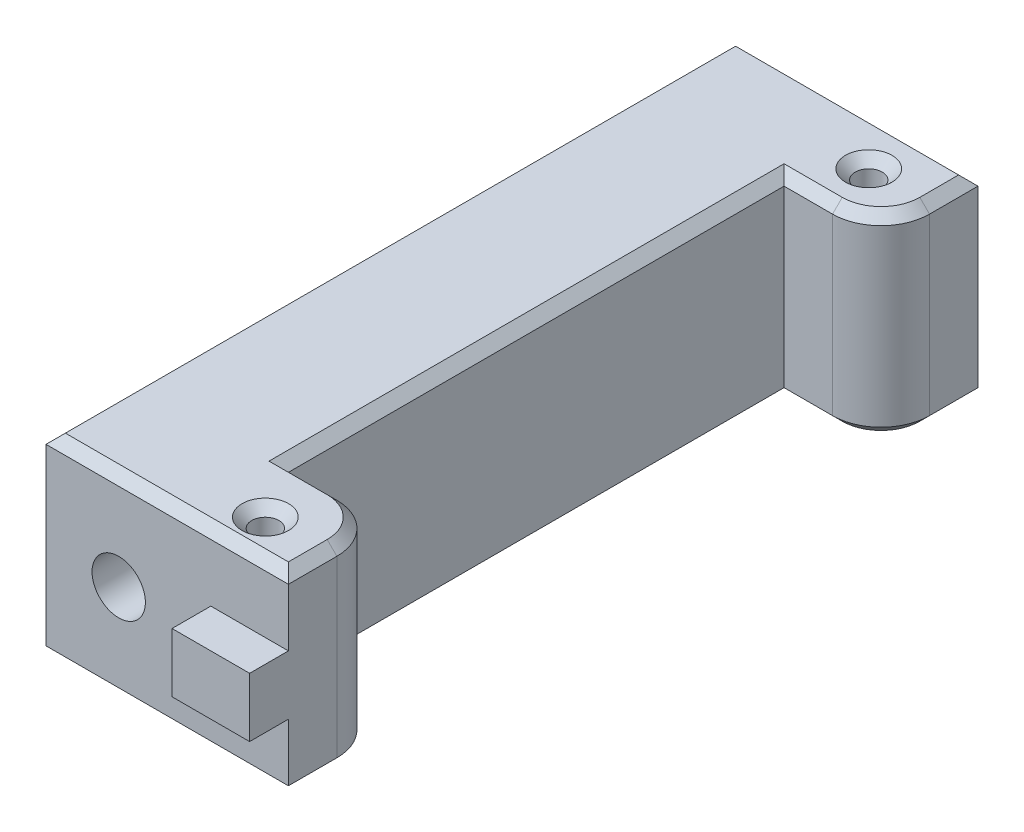
ISO-10303-21;
HEADER;
FILE_DESCRIPTION(('STEP AP214'),'2;1');
FILE_NAME('part.step','',(''),(''),'','','');
FILE_SCHEMA(('AUTOMOTIVE_DESIGN { 1 0 10303 214 1 1 1 1 }'));
ENDSEC;
DATA;
#1=APPLICATION_CONTEXT('core data for automotive mechanical design processes');
#2=APPLICATION_PROTOCOL_DEFINITION('international standard','automotive_design',2000,#1);
#3=PRODUCT_CONTEXT('',#1,'mechanical');
#4=PRODUCT('Part','Part','',(#3));
#5=PRODUCT_RELATED_PRODUCT_CATEGORY('part','',(#4));
#6=PRODUCT_DEFINITION_FORMATION('','',#4);
#7=PRODUCT_DEFINITION_CONTEXT('part definition',#1,'design');
#8=PRODUCT_DEFINITION('design','',#6,#7);
#9=PRODUCT_DEFINITION_SHAPE('','',#8);
#10=(LENGTH_UNIT() NAMED_UNIT(*) SI_UNIT(.MILLI.,.METRE.));
#11=(NAMED_UNIT(*) PLANE_ANGLE_UNIT() SI_UNIT($,.RADIAN.));
#12=(NAMED_UNIT(*) SI_UNIT($,.STERADIAN.) SOLID_ANGLE_UNIT());
#13=UNCERTAINTY_MEASURE_WITH_UNIT(LENGTH_MEASURE(1.E-05),#10,'distance_accuracy_value','');
#14=(GEOMETRIC_REPRESENTATION_CONTEXT(3) GLOBAL_UNCERTAINTY_ASSIGNED_CONTEXT((#13)) GLOBAL_UNIT_ASSIGNED_CONTEXT((#10,
#11,#12)) REPRESENTATION_CONTEXT('',''));
#15=CARTESIAN_POINT('',(0.,0.,0.));
#16=DIRECTION('',(0.,0.,1.));
#17=DIRECTION('',(1.,0.,0.));
#18=AXIS2_PLACEMENT_3D('',#15,#16,#17);
#19=CARTESIAN_POINT('',(25.,20.,0.));
#20=DIRECTION('',(0.,0.,-1.));
#21=DIRECTION('',(-1.,0.,0.));
#22=AXIS2_PLACEMENT_3D('',#19,#20,#21);
#23=PLANE('',#22);
#24=CARTESIAN_POINT('',(7.5,10.,0.));
#25=DIRECTION('',(0.,0.,-1.));
#26=DIRECTION('',(-1.,0.,0.));
#27=AXIS2_PLACEMENT_3D('',#24,#25,#26);
#28=CIRCLE('',#27,2.74999999999998);
#29=CARTESIAN_POINT('',(4.75000000000002,10.,0.));
#30=VERTEX_POINT('',#29);
#31=EDGE_CURVE('E235',#30,#30,#28,.T.);
#32=ORIENTED_EDGE('',*,*,#31,.T.);
#33=EDGE_LOOP('',(#32));
#34=FACE_BOUND('',#33,.T.);
#35=DIRECTION('',(0.,-1.,0.));
#36=VECTOR('',#35,1.);
#37=CARTESIAN_POINT('',(0.,20.,0.));
#38=LINE('',#37,#36);
#39=CARTESIAN_POINT('',(0.,19.,0.));
#40=VERTEX_POINT('',#39);
#41=CARTESIAN_POINT('',(0.,1.,0.));
#42=VERTEX_POINT('',#41);
#43=EDGE_CURVE('E238',#40,#42,#38,.T.);
#44=ORIENTED_EDGE('',*,*,#43,.T.);
#45=DIRECTION('',(1.,0.,0.));
#46=VECTOR('',#45,1.);
#47=CARTESIAN_POINT('',(25.,1.,0.));
#48=LINE('',#47,#46);
#49=CARTESIAN_POINT('',(25.,1.,0.));
#50=VERTEX_POINT('',#49);
#51=EDGE_CURVE('E322',#42,#50,#48,.T.);
#52=ORIENTED_EDGE('',*,*,#51,.T.);
#53=DIRECTION('',(0.,-1.,0.));
#54=VECTOR('',#53,1.);
#55=CARTESIAN_POINT('',(25.,20.,0.));
#56=LINE('',#55,#54);
#57=CARTESIAN_POINT('',(25.,6.95,0.));
#58=VERTEX_POINT('',#57);
#59=EDGE_CURVE('E253',#58,#50,#56,.T.);
#60=ORIENTED_EDGE('',*,*,#59,.F.);
#61=DIRECTION('',(1.,0.,0.));
#62=VECTOR('',#61,1.);
#63=CARTESIAN_POINT('',(17.,6.95,0.));
#64=LINE('',#63,#62);
#65=CARTESIAN_POINT('',(17.,6.95,0.));
#66=VERTEX_POINT('',#65);
#67=EDGE_CURVE('E214',#66,#58,#64,.T.);
#68=ORIENTED_EDGE('',*,*,#67,.F.);
#69=DIRECTION('',(0.,-1.,0.));
#70=VECTOR('',#69,1.);
#71=CARTESIAN_POINT('',(17.,6.95,0.));
#72=LINE('',#71,#70);
#73=CARTESIAN_POINT('',(17.,13.05,0.));
#74=VERTEX_POINT('',#73);
#75=EDGE_CURVE('E944',#74,#66,#72,.T.);
#76=ORIENTED_EDGE('',*,*,#75,.F.);
#77=DIRECTION('',(-1.,0.,0.));
#78=VECTOR('',#77,1.);
#79=CARTESIAN_POINT('',(17.,13.05,0.));
#80=LINE('',#79,#78);
#81=CARTESIAN_POINT('',(25.,13.05,0.));
#82=VERTEX_POINT('',#81);
#83=EDGE_CURVE('E398',#82,#74,#80,.T.);
#84=ORIENTED_EDGE('',*,*,#83,.F.);
#85=CARTESIAN_POINT('',(25.,19.,0.));
#86=VERTEX_POINT('',#85);
#87=EDGE_CURVE('E219',#86,#82,#56,.T.);
#88=ORIENTED_EDGE('',*,*,#87,.F.);
#89=DIRECTION('',(-1.,0.,0.));
#90=VECTOR('',#89,1.);
#91=CARTESIAN_POINT('',(25.,19.,0.));
#92=LINE('',#91,#90);
#93=EDGE_CURVE('E319',#86,#40,#92,.T.);
#94=ORIENTED_EDGE('',*,*,#93,.T.);
#95=EDGE_LOOP('',(#44,#52,#60,#68,#76,#84,#88,#94));
#96=FACE_BOUND('',#95,.T.);
#97=ADVANCED_FACE('F33',(#34,#96),#23,.F.);
#98=CARTESIAN_POINT('',(25.,20.,-10.));
#99=DIRECTION('',(-1.,0.,0.));
#100=DIRECTION('',(0.,0.,1.));
#101=AXIS2_PLACEMENT_3D('',#98,#99,#100);
#102=PLANE('',#101);
#103=ORIENTED_EDGE('',*,*,#59,.T.);
#104=DIRECTION('',(0.,0.,-1.));
#105=VECTOR('',#104,1.);
#106=CARTESIAN_POINT('',(25.,1.,-5.));
#107=LINE('',#106,#105);
#108=CARTESIAN_POINT('',(25.,1.,-5.));
#109=VERTEX_POINT('',#108);
#110=EDGE_CURVE('E326',#50,#109,#107,.T.);
#111=ORIENTED_EDGE('',*,*,#110,.T.);
#112=DIRECTION('',(0.,-1.,0.));
#113=VECTOR('',#112,1.);
#114=CARTESIAN_POINT('',(25.,20.,-5.));
#115=LINE('',#114,#113);
#116=CARTESIAN_POINT('',(25.,19.,-5.));
#117=VERTEX_POINT('',#116);
#118=EDGE_CURVE('E258',#109,#117,#115,.F.);
#119=ORIENTED_EDGE('',*,*,#118,.T.);
#120=DIRECTION('',(0.,0.,1.));
#121=VECTOR('',#120,1.);
#122=CARTESIAN_POINT('',(25.,19.,-10.));
#123=LINE('',#122,#121);
#124=EDGE_CURVE('E324',#117,#86,#123,.T.);
#125=ORIENTED_EDGE('',*,*,#124,.T.);
#126=ORIENTED_EDGE('',*,*,#87,.T.);
#127=DIRECTION('',(0.,0.,-1.));
#128=VECTOR('',#127,1.);
#129=CARTESIAN_POINT('',(25.,13.05,4.));
#130=LINE('',#129,#128);
#131=CARTESIAN_POINT('',(25.,13.05,4.));
#132=VERTEX_POINT('',#131);
#133=EDGE_CURVE('E199',#132,#82,#130,.T.);
#134=ORIENTED_EDGE('',*,*,#133,.F.);
#135=DIRECTION('',(0.,1.,0.));
#136=VECTOR('',#135,1.);
#137=CARTESIAN_POINT('',(25.,6.95,4.));
#138=LINE('',#137,#136);
#139=CARTESIAN_POINT('',(25.,6.95,4.));
#140=VERTEX_POINT('',#139);
#141=EDGE_CURVE('E205',#140,#132,#138,.T.);
#142=ORIENTED_EDGE('',*,*,#141,.F.);
#143=DIRECTION('',(0.,0.,-1.));
#144=VECTOR('',#143,1.);
#145=CARTESIAN_POINT('',(25.,6.95,4.));
#146=LINE('',#145,#144);
#147=EDGE_CURVE('E939',#140,#58,#146,.T.);
#148=ORIENTED_EDGE('',*,*,#147,.T.);
#149=EDGE_LOOP('',(#103,#111,#119,#125,#126,#134,#142,#148));
#150=FACE_BOUND('',#149,.T.);
#151=ADVANCED_FACE('F217',(#150),#102,.F.);
#152=CARTESIAN_POINT('',(15.,20.,-10.));
#153=DIRECTION('',(0.,0.,1.));
#154=DIRECTION('',(1.,0.,0.));
#155=AXIS2_PLACEMENT_3D('',#152,#153,#154);
#156=PLANE('',#155);
#157=DIRECTION('',(0.,-1.,0.));
#158=VECTOR('',#157,1.);
#159=CARTESIAN_POINT('',(20.,20.,-10.));
#160=LINE('',#159,#158);
#161=CARTESIAN_POINT('',(20.,19.,-10.));
#162=VERTEX_POINT('',#161);
#163=CARTESIAN_POINT('',(20.,1.,-10.));
#164=VERTEX_POINT('',#163);
#165=EDGE_CURVE('E255',#162,#164,#160,.T.);
#166=ORIENTED_EDGE('',*,*,#165,.T.);
#167=DIRECTION('',(-1.,0.,0.));
#168=VECTOR('',#167,1.);
#169=CARTESIAN_POINT('',(15.,1.,-10.));
#170=LINE('',#169,#168);
#171=CARTESIAN_POINT('',(15.,1.,-10.));
#172=VERTEX_POINT('',#171);
#173=EDGE_CURVE('E334',#164,#172,#170,.T.);
#174=ORIENTED_EDGE('',*,*,#173,.T.);
#175=DIRECTION('',(0.,-1.,0.));
#176=VECTOR('',#175,1.);
#177=CARTESIAN_POINT('',(15.,20.,-10.));
#178=LINE('',#177,#176);
#179=CARTESIAN_POINT('',(15.,19.,-10.));
#180=VERTEX_POINT('',#179);
#181=EDGE_CURVE('E250',#180,#172,#178,.T.);
#182=ORIENTED_EDGE('',*,*,#181,.F.);
#183=DIRECTION('',(1.,0.,0.));
#184=VECTOR('',#183,1.);
#185=CARTESIAN_POINT('',(15.,19.,-10.));
#186=LINE('',#185,#184);
#187=EDGE_CURVE('E332',#180,#162,#186,.T.);
#188=ORIENTED_EDGE('',*,*,#187,.T.);
#189=EDGE_LOOP('',(#166,#174,#182,#188));
#190=FACE_BOUND('',#189,.T.);
#191=ADVANCED_FACE('F527',(#190),#156,.F.);
#192=CARTESIAN_POINT('',(15.,20.,-61.12));
#193=DIRECTION('',(-1.,0.,0.));
#194=DIRECTION('',(0.,0.,1.));
#195=AXIS2_PLACEMENT_3D('',#192,#193,#194);
#196=PLANE('',#195);
#197=ORIENTED_EDGE('',*,*,#181,.T.);
#198=DIRECTION('',(0.,0.,-1.));
#199=VECTOR('',#198,1.);
#200=CARTESIAN_POINT('',(15.,1.,-61.12));
#201=LINE('',#200,#199);
#202=CARTESIAN_POINT('',(15.,1.,-61.12));
#203=VERTEX_POINT('',#202);
#204=EDGE_CURVE('E269',#172,#203,#201,.T.);
#205=ORIENTED_EDGE('',*,*,#204,.T.);
#206=DIRECTION('',(0.,-1.,0.));
#207=VECTOR('',#206,1.);
#208=CARTESIAN_POINT('',(15.,20.,-61.12));
#209=LINE('',#208,#207);
#210=CARTESIAN_POINT('',(15.,19.,-61.12));
#211=VERTEX_POINT('',#210);
#212=EDGE_CURVE('E247',#211,#203,#209,.T.);
#213=ORIENTED_EDGE('',*,*,#212,.F.);
#214=DIRECTION('',(0.,0.,1.));
#215=VECTOR('',#214,1.);
#216=CARTESIAN_POINT('',(15.,19.,-61.12));
#217=LINE('',#216,#215);
#218=EDGE_CURVE('E267',#211,#180,#217,.T.);
#219=ORIENTED_EDGE('',*,*,#218,.T.);
#220=EDGE_LOOP('',(#197,#205,#213,#219));
#221=FACE_BOUND('',#220,.T.);
#222=ADVANCED_FACE('F442',(#221),#196,.F.);
#223=CARTESIAN_POINT('',(25.,20.,-61.12));
#224=DIRECTION('',(0.,0.,-1.));
#225=DIRECTION('',(-1.,0.,0.));
#226=AXIS2_PLACEMENT_3D('',#223,#224,#225);
#227=PLANE('',#226);
#228=ORIENTED_EDGE('',*,*,#212,.T.);
#229=DIRECTION('',(1.,0.,0.));
#230=VECTOR('',#229,1.);
#231=CARTESIAN_POINT('',(20.,1.,-61.12));
#232=LINE('',#231,#230);
#233=CARTESIAN_POINT('',(20.,1.,-61.12));
#234=VERTEX_POINT('',#233);
#235=EDGE_CURVE('E301',#203,#234,#232,.T.);
#236=ORIENTED_EDGE('',*,*,#235,.T.);
#237=DIRECTION('',(0.,-1.,0.));
#238=VECTOR('',#237,1.);
#239=CARTESIAN_POINT('',(20.,20.,-61.12));
#240=LINE('',#239,#238);
#241=CARTESIAN_POINT('',(20.,19.,-61.12));
#242=VERTEX_POINT('',#241);
#243=EDGE_CURVE('E264',#234,#242,#240,.F.);
#244=ORIENTED_EDGE('',*,*,#243,.T.);
#245=DIRECTION('',(-1.,0.,0.));
#246=VECTOR('',#245,1.);
#247=CARTESIAN_POINT('',(25.,19.,-61.12));
#248=LINE('',#247,#246);
#249=EDGE_CURVE('E299',#242,#211,#248,.T.);
#250=ORIENTED_EDGE('',*,*,#249,.T.);
#251=EDGE_LOOP('',(#228,#236,#244,#250));
#252=FACE_BOUND('',#251,.T.);
#253=ADVANCED_FACE('F439',(#252),#227,.F.);
#254=CARTESIAN_POINT('',(25.,20.,-71.12));
#255=DIRECTION('',(-1.,0.,0.));
#256=DIRECTION('',(0.,0.,1.));
#257=AXIS2_PLACEMENT_3D('',#254,#255,#256);
#258=PLANE('',#257);
#259=DIRECTION('',(0.,-1.,0.));
#260=VECTOR('',#259,1.);
#261=CARTESIAN_POINT('',(25.,20.,-66.12));
#262=LINE('',#261,#260);
#263=CARTESIAN_POINT('',(25.,19.,-66.12));
#264=VERTEX_POINT('',#263);
#265=CARTESIAN_POINT('',(25.,1.,-66.12));
#266=VERTEX_POINT('',#265);
#267=EDGE_CURVE('E261',#264,#266,#262,.T.);
#268=ORIENTED_EDGE('',*,*,#267,.T.);
#269=DIRECTION('',(0.,0.,-1.));
#270=VECTOR('',#269,1.);
#271=CARTESIAN_POINT('',(25.,1.,-71.12));
#272=LINE('',#271,#270);
#273=CARTESIAN_POINT('',(25.,1.,-71.12));
#274=VERTEX_POINT('',#273);
#275=EDGE_CURVE('E309',#266,#274,#272,.T.);
#276=ORIENTED_EDGE('',*,*,#275,.T.);
#277=DIRECTION('',(0.,-1.,0.));
#278=VECTOR('',#277,1.);
#279=CARTESIAN_POINT('',(25.,20.,-71.12));
#280=LINE('',#279,#278);
#281=CARTESIAN_POINT('',(25.,19.,-71.12));
#282=VERTEX_POINT('',#281);
#283=EDGE_CURVE('E244',#282,#274,#280,.T.);
#284=ORIENTED_EDGE('',*,*,#283,.F.);
#285=DIRECTION('',(0.,0.,1.));
#286=VECTOR('',#285,1.);
#287=CARTESIAN_POINT('',(25.,19.,-71.12));
#288=LINE('',#287,#286);
#289=EDGE_CURVE('E307',#282,#264,#288,.T.);
#290=ORIENTED_EDGE('',*,*,#289,.T.);
#291=EDGE_LOOP('',(#268,#276,#284,#290));
#292=FACE_BOUND('',#291,.T.);
#293=ADVANCED_FACE('F471',(#292),#258,.F.);
#294=CARTESIAN_POINT('',(0.,20.,-71.12));
#295=DIRECTION('',(0.,0.,1.));
#296=DIRECTION('',(1.,0.,0.));
#297=AXIS2_PLACEMENT_3D('',#294,#295,#296);
#298=PLANE('',#297);
#299=CARTESIAN_POINT('',(7.5,10.,-71.12));
#300=DIRECTION('',(0.,0.,-1.));
#301=DIRECTION('',(-1.,0.,0.));
#302=AXIS2_PLACEMENT_3D('',#299,#300,#301);
#303=CIRCLE('',#302,5.);
#304=CARTESIAN_POINT('',(2.5,10.,-71.12));
#305=VERTEX_POINT('',#304);
#306=EDGE_CURVE('E221',#305,#305,#303,.T.);
#307=ORIENTED_EDGE('',*,*,#306,.F.);
#308=EDGE_LOOP('',(#307));
#309=FACE_BOUND('',#308,.T.);
#310=ORIENTED_EDGE('',*,*,#283,.T.);
#311=DIRECTION('',(-1.,0.,0.));
#312=VECTOR('',#311,1.);
#313=CARTESIAN_POINT('',(0.,1.,-71.12));
#314=LINE('',#313,#312);
#315=CARTESIAN_POINT('',(0.,1.,-71.12));
#316=VERTEX_POINT('',#315);
#317=EDGE_CURVE('E313',#274,#316,#314,.T.);
#318=ORIENTED_EDGE('',*,*,#317,.T.);
#319=DIRECTION('',(0.,-1.,0.));
#320=VECTOR('',#319,1.);
#321=CARTESIAN_POINT('',(0.,20.,-71.12));
#322=LINE('',#321,#320);
#323=CARTESIAN_POINT('',(0.,19.,-71.12));
#324=VERTEX_POINT('',#323);
#325=EDGE_CURVE('E241',#324,#316,#322,.T.);
#326=ORIENTED_EDGE('',*,*,#325,.F.);
#327=DIRECTION('',(1.,0.,0.));
#328=VECTOR('',#327,1.);
#329=CARTESIAN_POINT('',(0.,19.,-71.12));
#330=LINE('',#329,#328);
#331=EDGE_CURVE('E311',#324,#282,#330,.T.);
#332=ORIENTED_EDGE('',*,*,#331,.T.);
#333=EDGE_LOOP('',(#310,#318,#326,#332));
#334=FACE_BOUND('',#333,.T.);
#335=ADVANCED_FACE('F475',(#309,#334),#298,.F.);
#336=CARTESIAN_POINT('',(0.,20.,0.));
#337=DIRECTION('',(1.,0.,0.));
#338=DIRECTION('',(0.,0.,-1.));
#339=AXIS2_PLACEMENT_3D('',#336,#337,#338);
#340=PLANE('',#339);
#341=ORIENTED_EDGE('',*,*,#325,.T.);
#342=DIRECTION('',(0.,0.,1.));
#343=VECTOR('',#342,1.);
#344=CARTESIAN_POINT('',(0.,1.,0.));
#345=LINE('',#344,#343);
#346=EDGE_CURVE('E317',#316,#42,#345,.T.);
#347=ORIENTED_EDGE('',*,*,#346,.T.);
#348=ORIENTED_EDGE('',*,*,#43,.F.);
#349=DIRECTION('',(0.,0.,-1.));
#350=VECTOR('',#349,1.);
#351=CARTESIAN_POINT('',(0.,19.,0.));
#352=LINE('',#351,#350);
#353=EDGE_CURVE('E315',#40,#324,#352,.T.);
#354=ORIENTED_EDGE('',*,*,#353,.T.);
#355=EDGE_LOOP('',(#341,#347,#348,#354));
#356=FACE_BOUND('',#355,.T.);
#357=ADVANCED_FACE('F490',(#356),#340,.F.);
#358=CARTESIAN_POINT('',(0.,20.,0.));
#359=DIRECTION('',(0.,-1.,0.));
#360=DIRECTION('',(0.,0.,-1.));
#361=AXIS2_PLACEMENT_3D('',#358,#359,#360);
#362=PLANE('',#361);
#363=DIRECTION('',(0.,0.,1.));
#364=VECTOR('',#363,1.);
#365=CARTESIAN_POINT('',(1.00000000000001,20.,0.));
#366=LINE('',#365,#364);
#367=CARTESIAN_POINT('',(1.00000000000001,20.,-70.12));
#368=VERTEX_POINT('',#367);
#369=CARTESIAN_POINT('',(1.00000000000001,20.,-1.00000000000001));
#370=VERTEX_POINT('',#369);
#371=EDGE_CURVE('E42',#368,#370,#366,.T.);
#372=ORIENTED_EDGE('',*,*,#371,.T.);
#373=DIRECTION('',(1.,0.,0.));
#374=VECTOR('',#373,1.);
#375=CARTESIAN_POINT('',(0.,20.,-1.00000000000001));
#376=LINE('',#375,#374);
#377=CARTESIAN_POINT('',(24.,20.,-1.00000000000002));
#378=VERTEX_POINT('',#377);
#379=EDGE_CURVE('E11',#370,#378,#376,.T.);
#380=ORIENTED_EDGE('',*,*,#379,.T.);
#381=DIRECTION('',(0.,0.,-1.));
#382=VECTOR('',#381,1.);
#383=CARTESIAN_POINT('',(24.,20.,0.));
#384=LINE('',#383,#382);
#385=CARTESIAN_POINT('',(24.,20.,-5.));
#386=VERTEX_POINT('',#385);
#387=EDGE_CURVE('E354',#378,#386,#384,.T.);
#388=ORIENTED_EDGE('',*,*,#387,.T.);
#389=CARTESIAN_POINT('',(20.,20.,-5.));
#390=DIRECTION('',(0.,-1.,0.));
#391=DIRECTION('',(0.,0.,-1.));
#392=AXIS2_PLACEMENT_3D('',#389,#390,#391);
#393=CIRCLE('',#392,3.99999999999999);
#394=CARTESIAN_POINT('',(20.,20.,-8.99999999999999));
#395=VERTEX_POINT('',#394);
#396=EDGE_CURVE('E356',#386,#395,#393,.F.);
#397=ORIENTED_EDGE('',*,*,#396,.T.);
#398=DIRECTION('',(-1.,0.,0.));
#399=VECTOR('',#398,1.);
#400=CARTESIAN_POINT('',(0.,20.,-8.99999999999999));
#401=LINE('',#400,#399);
#402=CARTESIAN_POINT('',(14.,20.,-8.99999999999999));
#403=VERTEX_POINT('',#402);
#404=EDGE_CURVE('E358',#395,#403,#401,.T.);
#405=ORIENTED_EDGE('',*,*,#404,.T.);
#406=DIRECTION('',(0.,0.,-1.));
#407=VECTOR('',#406,1.);
#408=CARTESIAN_POINT('',(14.,20.,0.));
#409=LINE('',#408,#407);
#410=CARTESIAN_POINT('',(14.,20.,-62.12));
#411=VERTEX_POINT('',#410);
#412=EDGE_CURVE('E360',#403,#411,#409,.T.);
#413=ORIENTED_EDGE('',*,*,#412,.T.);
#414=DIRECTION('',(1.,0.,0.));
#415=VECTOR('',#414,1.);
#416=CARTESIAN_POINT('',(0.,20.,-62.12));
#417=LINE('',#416,#415);
#418=CARTESIAN_POINT('',(20.,20.,-62.12));
#419=VERTEX_POINT('',#418);
#420=EDGE_CURVE('E362',#411,#419,#417,.T.);
#421=ORIENTED_EDGE('',*,*,#420,.T.);
#422=CARTESIAN_POINT('',(20.,20.,-66.12));
#423=DIRECTION('',(0.,-1.,0.));
#424=DIRECTION('',(0.,0.,-1.));
#425=AXIS2_PLACEMENT_3D('',#422,#423,#424);
#426=CIRCLE('',#425,3.99999999999999);
#427=CARTESIAN_POINT('',(24.,20.,-66.12));
#428=VERTEX_POINT('',#427);
#429=EDGE_CURVE('E364',#419,#428,#426,.F.);
#430=ORIENTED_EDGE('',*,*,#429,.T.);
#431=DIRECTION('',(0.,0.,-1.));
#432=VECTOR('',#431,1.);
#433=CARTESIAN_POINT('',(24.,20.,0.));
#434=LINE('',#433,#432);
#435=CARTESIAN_POINT('',(24.,20.,-70.12));
#436=VERTEX_POINT('',#435);
#437=EDGE_CURVE('E366',#428,#436,#434,.T.);
#438=ORIENTED_EDGE('',*,*,#437,.T.);
#439=DIRECTION('',(-1.,0.,0.));
#440=VECTOR('',#439,1.);
#441=CARTESIAN_POINT('',(0.,20.,-70.12));
#442=LINE('',#441,#440);
#443=EDGE_CURVE('E53',#436,#368,#442,.T.);
#444=ORIENTED_EDGE('',*,*,#443,.T.);
#445=EDGE_LOOP('',(#372,#380,#388,#397,#405,#413,#421,#430,#438,#444));
#446=FACE_BOUND('',#445,.T.);
#447=CARTESIAN_POINT('',(18.81,20.,-66.04));
#448=DIRECTION('',(0.,-1.,0.));
#449=DIRECTION('',(0.,0.,-1.));
#450=AXIS2_PLACEMENT_3D('',#447,#448,#449);
#451=CIRCLE('',#450,2.39999999999999);
#452=CARTESIAN_POINT('',(18.81,20.,-68.44));
#453=VERTEX_POINT('',#452);
#454=EDGE_CURVE('E351',#453,#453,#451,.T.);
#455=ORIENTED_EDGE('',*,*,#454,.T.);
#456=EDGE_LOOP('',(#455));
#457=FACE_BOUND('',#456,.T.);
#458=CARTESIAN_POINT('',(18.81,20.,-3.81));
#459=DIRECTION('',(0.,-1.,0.));
#460=DIRECTION('',(0.,0.,-1.));
#461=AXIS2_PLACEMENT_3D('',#458,#459,#460);
#462=CIRCLE('',#461,2.40000000000002);
#463=CARTESIAN_POINT('',(18.81,20.,-6.21000000000002));
#464=VERTEX_POINT('',#463);
#465=EDGE_CURVE('E348',#464,#464,#462,.T.);
#466=ORIENTED_EDGE('',*,*,#465,.T.);
#467=EDGE_LOOP('',(#466));
#468=FACE_BOUND('',#467,.T.);
#469=ADVANCED_FACE('F504',(#446,#457,#468),#362,.F.);
#470=CARTESIAN_POINT('',(0.,0.,0.));
#471=DIRECTION('',(0.,-1.,0.));
#472=DIRECTION('',(0.,0.,-1.));
#473=AXIS2_PLACEMENT_3D('',#470,#471,#472);
#474=PLANE('',#473);
#475=DIRECTION('',(-1.,0.,0.));
#476=VECTOR('',#475,1.);
#477=CARTESIAN_POINT('',(15.,0.,-62.12));
#478=LINE('',#477,#476);
#479=CARTESIAN_POINT('',(20.,0.,-62.12));
#480=VERTEX_POINT('',#479);
#481=CARTESIAN_POINT('',(14.,0.,-62.12));
#482=VERTEX_POINT('',#481);
#483=EDGE_CURVE('E294',#480,#482,#478,.T.);
#484=ORIENTED_EDGE('',*,*,#483,.T.);
#485=DIRECTION('',(0.,0.,1.));
#486=VECTOR('',#485,1.);
#487=CARTESIAN_POINT('',(14.,0.,-10.));
#488=LINE('',#487,#486);
#489=CARTESIAN_POINT('',(14.,0.,-8.99999999999999));
#490=VERTEX_POINT('',#489);
#491=EDGE_CURVE('E296',#482,#490,#488,.T.);
#492=ORIENTED_EDGE('',*,*,#491,.T.);
#493=DIRECTION('',(1.,0.,0.));
#494=VECTOR('',#493,1.);
#495=CARTESIAN_POINT('',(20.,0.,-8.99999999999999));
#496=LINE('',#495,#494);
#497=CARTESIAN_POINT('',(20.,0.,-8.99999999999999));
#498=VERTEX_POINT('',#497);
#499=EDGE_CURVE('E278',#490,#498,#496,.T.);
#500=ORIENTED_EDGE('',*,*,#499,.T.);
#501=CARTESIAN_POINT('',(20.,0.,-5.));
#502=DIRECTION('',(0.,-1.,0.));
#503=DIRECTION('',(0.,0.,-1.));
#504=AXIS2_PLACEMENT_3D('',#501,#502,#503);
#505=CIRCLE('',#504,3.99999999999999);
#506=CARTESIAN_POINT('',(24.,0.,-5.));
#507=VERTEX_POINT('',#506);
#508=EDGE_CURVE('E280',#498,#507,#505,.T.);
#509=ORIENTED_EDGE('',*,*,#508,.T.);
#510=DIRECTION('',(0.,0.,1.));
#511=VECTOR('',#510,1.);
#512=CARTESIAN_POINT('',(24.,0.,0.));
#513=LINE('',#512,#511);
#514=CARTESIAN_POINT('',(24.,0.,-1.00000000000001));
#515=VERTEX_POINT('',#514);
#516=EDGE_CURVE('E282',#507,#515,#513,.T.);
#517=ORIENTED_EDGE('',*,*,#516,.T.);
#518=DIRECTION('',(-1.,0.,0.));
#519=VECTOR('',#518,1.);
#520=CARTESIAN_POINT('',(0.,0.,-1.00000000000001));
#521=LINE('',#520,#519);
#522=CARTESIAN_POINT('',(1.00000000000001,0.,-1.00000000000001));
#523=VERTEX_POINT('',#522);
#524=EDGE_CURVE('E284',#515,#523,#521,.T.);
#525=ORIENTED_EDGE('',*,*,#524,.T.);
#526=DIRECTION('',(0.,0.,-1.));
#527=VECTOR('',#526,1.);
#528=CARTESIAN_POINT('',(1.00000000000001,0.,-71.12));
#529=LINE('',#528,#527);
#530=CARTESIAN_POINT('',(1.00000000000001,0.,-70.12));
#531=VERTEX_POINT('',#530);
#532=EDGE_CURVE('E286',#523,#531,#529,.T.);
#533=ORIENTED_EDGE('',*,*,#532,.T.);
#534=DIRECTION('',(1.,0.,0.));
#535=VECTOR('',#534,1.);
#536=CARTESIAN_POINT('',(25.,0.,-70.12));
#537=LINE('',#536,#535);
#538=CARTESIAN_POINT('',(24.,0.,-70.12));
#539=VERTEX_POINT('',#538);
#540=EDGE_CURVE('E288',#531,#539,#537,.T.);
#541=ORIENTED_EDGE('',*,*,#540,.T.);
#542=DIRECTION('',(0.,0.,1.));
#543=VECTOR('',#542,1.);
#544=CARTESIAN_POINT('',(24.,0.,-66.12));
#545=LINE('',#544,#543);
#546=CARTESIAN_POINT('',(24.,0.,-66.12));
#547=VERTEX_POINT('',#546);
#548=EDGE_CURVE('E290',#539,#547,#545,.T.);
#549=ORIENTED_EDGE('',*,*,#548,.T.);
#550=CARTESIAN_POINT('',(20.,0.,-66.12));
#551=DIRECTION('',(0.,-1.,0.));
#552=DIRECTION('',(0.,0.,-1.));
#553=AXIS2_PLACEMENT_3D('',#550,#551,#552);
#554=CIRCLE('',#553,4.);
#555=EDGE_CURVE('E292',#547,#480,#554,.T.);
#556=ORIENTED_EDGE('',*,*,#555,.T.);
#557=EDGE_LOOP('',(#484,#492,#500,#509,#517,#525,#533,#541,#549,#556));
#558=FACE_BOUND('',#557,.T.);
#559=CARTESIAN_POINT('',(18.81,0.,-66.04));
#560=DIRECTION('',(0.,-1.,0.));
#561=DIRECTION('',(0.,0.,-1.));
#562=AXIS2_PLACEMENT_3D('',#559,#560,#561);
#563=CIRCLE('',#562,2.4);
#564=CARTESIAN_POINT('',(18.81,0.,-68.44));
#565=VERTEX_POINT('',#564);
#566=EDGE_CURVE('E275',#565,#565,#563,.F.);
#567=ORIENTED_EDGE('',*,*,#566,.T.);
#568=EDGE_LOOP('',(#567));
#569=FACE_BOUND('',#568,.T.);
#570=CARTESIAN_POINT('',(18.81,0.,-3.81));
#571=DIRECTION('',(0.,-1.,0.));
#572=DIRECTION('',(0.,0.,-1.));
#573=AXIS2_PLACEMENT_3D('',#570,#571,#572);
#574=CIRCLE('',#573,2.40000000000001);
#575=CARTESIAN_POINT('',(18.81,0.,-6.21000000000001));
#576=VERTEX_POINT('',#575);
#577=EDGE_CURVE('E272',#576,#576,#574,.F.);
#578=ORIENTED_EDGE('',*,*,#577,.T.);
#579=EDGE_LOOP('',(#578));
#580=FACE_BOUND('',#579,.T.);
#581=ADVANCED_FACE('F507',(#558,#569,#580),#474,.T.);
#582=CARTESIAN_POINT('',(7.5,10.,-71.12));
#583=DIRECTION('',(0.,0.,-1.));
#584=DIRECTION('',(-1.,0.,0.));
#585=AXIS2_PLACEMENT_3D('',#582,#583,#584);
#586=CYLINDRICAL_SURFACE('',#585,2.74999999999998);
#587=ORIENTED_EDGE('',*,*,#31,.F.);
#588=EDGE_LOOP('',(#587));
#589=FACE_BOUND('',#588,.T.);
#590=CARTESIAN_POINT('',(7.5,10.,-6.11999999999999));
#591=DIRECTION('',(0.,0.,-1.));
#592=DIRECTION('',(-1.,0.,0.));
#593=AXIS2_PLACEMENT_3D('',#590,#591,#592);
#594=CIRCLE('',#593,2.74999999999998);
#595=CARTESIAN_POINT('',(4.75000000000001,10.,-6.11999999999999));
#596=VERTEX_POINT('',#595);
#597=EDGE_CURVE('E232',#596,#596,#594,.T.);
#598=ORIENTED_EDGE('',*,*,#597,.T.);
#599=EDGE_LOOP('',(#598));
#600=FACE_BOUND('',#599,.T.);
#601=ADVANCED_FACE('F825',(#589,#600),#586,.F.);
#602=CARTESIAN_POINT('',(10.25,10.,-6.11999999999999));
#603=DIRECTION('',(0.,0.,1.));
#604=DIRECTION('',(1.,0.,0.));
#605=AXIS2_PLACEMENT_3D('',#602,#603,#604);
#606=PLANE('',#605);
#607=ORIENTED_EDGE('',*,*,#597,.F.);
#608=EDGE_LOOP('',(#607));
#609=FACE_BOUND('',#608,.T.);
#610=CARTESIAN_POINT('',(7.5,10.,-6.11999999999999));
#611=DIRECTION('',(0.,0.,-1.));
#612=DIRECTION('',(-1.,0.,0.));
#613=AXIS2_PLACEMENT_3D('',#610,#611,#612);
#614=CIRCLE('',#613,4.99999999999998);
#615=CARTESIAN_POINT('',(2.50000000000001,10.,-6.11999999999999));
#616=VERTEX_POINT('',#615);
#617=EDGE_CURVE('E224',#616,#616,#614,.T.);
#618=ORIENTED_EDGE('',*,*,#617,.T.);
#619=EDGE_LOOP('',(#618));
#620=FACE_BOUND('',#619,.T.);
#621=ADVANCED_FACE('F816',(#609,#620),#606,.F.);
#622=CARTESIAN_POINT('',(7.5,10.,-71.12));
#623=DIRECTION('',(0.,0.,-1.));
#624=DIRECTION('',(-1.,0.,0.));
#625=AXIS2_PLACEMENT_3D('',#622,#623,#624);
#626=CYLINDRICAL_SURFACE('',#625,4.99999999999999);
#627=ORIENTED_EDGE('',*,*,#617,.F.);
#628=EDGE_LOOP('',(#627));
#629=FACE_BOUND('',#628,.T.);
#630=ORIENTED_EDGE('',*,*,#306,.T.);
#631=EDGE_LOOP('',(#630));
#632=FACE_BOUND('',#631,.T.);
#633=ADVANCED_FACE('F794',(#629,#632),#626,.F.);
#634=CARTESIAN_POINT('',(17.,13.05,4.));
#635=DIRECTION('',(0.,-1.,0.));
#636=DIRECTION('',(0.,0.,-1.));
#637=AXIS2_PLACEMENT_3D('',#634,#635,#636);
#638=PLANE('',#637);
#639=ORIENTED_EDGE('',*,*,#83,.T.);
#640=DIRECTION('',(0.,0.,-1.));
#641=VECTOR('',#640,1.);
#642=CARTESIAN_POINT('',(17.,13.05,4.));
#643=LINE('',#642,#641);
#644=CARTESIAN_POINT('',(17.,13.05,4.));
#645=VERTEX_POINT('',#644);
#646=EDGE_CURVE('E201',#645,#74,#643,.T.);
#647=ORIENTED_EDGE('',*,*,#646,.F.);
#648=DIRECTION('',(-1.,0.,0.));
#649=VECTOR('',#648,1.);
#650=CARTESIAN_POINT('',(17.,13.05,4.));
#651=LINE('',#650,#649);
#652=EDGE_CURVE('E194',#132,#645,#651,.T.);
#653=ORIENTED_EDGE('',*,*,#652,.F.);
#654=ORIENTED_EDGE('',*,*,#133,.T.);
#655=EDGE_LOOP('',(#639,#647,#653,#654));
#656=FACE_BOUND('',#655,.T.);
#657=ADVANCED_FACE('F197',(#656),#638,.F.);
#658=CARTESIAN_POINT('',(17.,6.95,4.));
#659=DIRECTION('',(1.,0.,0.));
#660=DIRECTION('',(0.,0.,-1.));
#661=AXIS2_PLACEMENT_3D('',#658,#659,#660);
#662=PLANE('',#661);
#663=ORIENTED_EDGE('',*,*,#75,.T.);
#664=DIRECTION('',(0.,0.,-1.));
#665=VECTOR('',#664,1.);
#666=CARTESIAN_POINT('',(17.,6.95,4.));
#667=LINE('',#666,#665);
#668=CARTESIAN_POINT('',(17.,6.95,4.));
#669=VERTEX_POINT('',#668);
#670=EDGE_CURVE('E226',#669,#66,#667,.T.);
#671=ORIENTED_EDGE('',*,*,#670,.F.);
#672=DIRECTION('',(0.,-1.,0.));
#673=VECTOR('',#672,1.);
#674=CARTESIAN_POINT('',(17.,6.95,4.));
#675=LINE('',#674,#673);
#676=EDGE_CURVE('E204',#645,#669,#675,.T.);
#677=ORIENTED_EDGE('',*,*,#676,.F.);
#678=ORIENTED_EDGE('',*,*,#646,.T.);
#679=EDGE_LOOP('',(#663,#671,#677,#678));
#680=FACE_BOUND('',#679,.T.);
#681=ADVANCED_FACE('F777',(#680),#662,.F.);
#682=CARTESIAN_POINT('',(17.,6.95,4.));
#683=DIRECTION('',(0.,1.,0.));
#684=DIRECTION('',(0.,0.,1.));
#685=AXIS2_PLACEMENT_3D('',#682,#683,#684);
#686=PLANE('',#685);
#687=ORIENTED_EDGE('',*,*,#67,.T.);
#688=ORIENTED_EDGE('',*,*,#147,.F.);
#689=DIRECTION('',(1.,0.,0.));
#690=VECTOR('',#689,1.);
#691=CARTESIAN_POINT('',(17.,6.95,4.));
#692=LINE('',#691,#690);
#693=EDGE_CURVE('E210',#669,#140,#692,.T.);
#694=ORIENTED_EDGE('',*,*,#693,.F.);
#695=ORIENTED_EDGE('',*,*,#670,.T.);
#696=EDGE_LOOP('',(#687,#688,#694,#695));
#697=FACE_BOUND('',#696,.T.);
#698=ADVANCED_FACE('F769',(#697),#686,.F.);
#699=CARTESIAN_POINT('',(0.,0.,4.));
#700=DIRECTION('',(0.,0.,-1.));
#701=DIRECTION('',(-1.,0.,0.));
#702=AXIS2_PLACEMENT_3D('',#699,#700,#701);
#703=PLANE('',#702);
#704=ORIENTED_EDGE('',*,*,#141,.T.);
#705=ORIENTED_EDGE('',*,*,#652,.T.);
#706=ORIENTED_EDGE('',*,*,#676,.T.);
#707=ORIENTED_EDGE('',*,*,#693,.T.);
#708=EDGE_LOOP('',(#704,#705,#706,#707));
#709=FACE_BOUND('',#708,.T.);
#710=ADVANCED_FACE('F208',(#709),#703,.F.);
#711=CARTESIAN_POINT('',(18.81,20.,-66.04));
#712=DIRECTION('',(0.,-1.,0.));
#713=DIRECTION('',(0.,0.,-1.));
#714=AXIS2_PLACEMENT_3D('',#711,#712,#713);
#715=CYLINDRICAL_SURFACE('',#714,1.4);
#716=CARTESIAN_POINT('',(18.81,1.,-66.04));
#717=DIRECTION('',(0.,-1.,0.));
#718=DIRECTION('',(0.,0.,-1.));
#719=AXIS2_PLACEMENT_3D('',#716,#717,#718);
#720=CIRCLE('',#719,1.4);
#721=CARTESIAN_POINT('',(18.81,1.,-67.44));
#722=VERTEX_POINT('',#721);
#723=EDGE_CURVE('E339',#722,#722,#720,.T.);
#724=ORIENTED_EDGE('',*,*,#723,.T.);
#725=EDGE_LOOP('',(#724));
#726=FACE_BOUND('',#725,.T.);
#727=CARTESIAN_POINT('',(18.81,19.,-66.04));
#728=DIRECTION('',(0.,-1.,0.));
#729=DIRECTION('',(0.,0.,-1.));
#730=AXIS2_PLACEMENT_3D('',#727,#728,#729);
#731=CIRCLE('',#730,1.4);
#732=CARTESIAN_POINT('',(18.81,19.,-67.44));
#733=VERTEX_POINT('',#732);
#734=EDGE_CURVE('E336',#733,#733,#731,.F.);
#735=ORIENTED_EDGE('',*,*,#734,.T.);
#736=EDGE_LOOP('',(#735));
#737=FACE_BOUND('',#736,.T.);
#738=ADVANCED_FACE('F751',(#726,#737),#715,.F.);
#739=CARTESIAN_POINT('',(18.81,20.,-3.81));
#740=DIRECTION('',(0.,-1.,0.));
#741=DIRECTION('',(0.,0.,-1.));
#742=AXIS2_PLACEMENT_3D('',#739,#740,#741);
#743=CYLINDRICAL_SURFACE('',#742,1.4);
#744=CARTESIAN_POINT('',(18.81,1.,-3.81));
#745=DIRECTION('',(0.,-1.,0.));
#746=DIRECTION('',(0.,0.,-1.));
#747=AXIS2_PLACEMENT_3D('',#744,#745,#746);
#748=CIRCLE('',#747,1.4);
#749=CARTESIAN_POINT('',(18.81,1.,-5.21));
#750=VERTEX_POINT('',#749);
#751=EDGE_CURVE('E345',#750,#750,#748,.T.);
#752=ORIENTED_EDGE('',*,*,#751,.T.);
#753=EDGE_LOOP('',(#752));
#754=FACE_BOUND('',#753,.T.);
#755=CARTESIAN_POINT('',(18.81,19.,-3.81));
#756=DIRECTION('',(0.,-1.,0.));
#757=DIRECTION('',(0.,0.,-1.));
#758=AXIS2_PLACEMENT_3D('',#755,#756,#757);
#759=CIRCLE('',#758,1.4);
#760=CARTESIAN_POINT('',(18.81,19.,-5.21));
#761=VERTEX_POINT('',#760);
#762=EDGE_CURVE('E342',#761,#761,#759,.F.);
#763=ORIENTED_EDGE('',*,*,#762,.T.);
#764=EDGE_LOOP('',(#763));
#765=FACE_BOUND('',#764,.T.);
#766=ADVANCED_FACE('F534',(#754,#765),#743,.F.);
#767=CARTESIAN_POINT('',(20.,20.,-5.));
#768=DIRECTION('',(0.,-1.,0.));
#769=DIRECTION('',(0.,0.,-1.));
#770=AXIS2_PLACEMENT_3D('',#767,#768,#769);
#771=CYLINDRICAL_SURFACE('',#770,5.);
#772=ORIENTED_EDGE('',*,*,#118,.F.);
#773=CARTESIAN_POINT('',(20.,1.,-5.));
#774=DIRECTION('',(0.,-1.,0.));
#775=DIRECTION('',(0.,0.,-1.));
#776=AXIS2_PLACEMENT_3D('',#773,#774,#775);
#777=CIRCLE('',#776,5.);
#778=EDGE_CURVE('E330',#109,#164,#777,.F.);
#779=ORIENTED_EDGE('',*,*,#778,.T.);
#780=ORIENTED_EDGE('',*,*,#165,.F.);
#781=CARTESIAN_POINT('',(20.,19.,-5.));
#782=DIRECTION('',(0.,-1.,0.));
#783=DIRECTION('',(0.,0.,-1.));
#784=AXIS2_PLACEMENT_3D('',#781,#782,#783);
#785=CIRCLE('',#784,5.);
#786=EDGE_CURVE('E328',#162,#117,#785,.T.);
#787=ORIENTED_EDGE('',*,*,#786,.T.);
#788=EDGE_LOOP('',(#772,#779,#780,#787));
#789=FACE_BOUND('',#788,.T.);
#790=ADVANCED_FACE('F531',(#789),#771,.T.);
#791=CARTESIAN_POINT('',(20.,20.,-66.12));
#792=DIRECTION('',(0.,-1.,0.));
#793=DIRECTION('',(0.,0.,-1.));
#794=AXIS2_PLACEMENT_3D('',#791,#792,#793);
#795=CYLINDRICAL_SURFACE('',#794,5.);
#796=ORIENTED_EDGE('',*,*,#243,.F.);
#797=CARTESIAN_POINT('',(20.,1.,-66.12));
#798=DIRECTION('',(0.,-1.,0.));
#799=DIRECTION('',(0.,0.,-1.));
#800=AXIS2_PLACEMENT_3D('',#797,#798,#799);
#801=CIRCLE('',#800,5.);
#802=EDGE_CURVE('E305',#234,#266,#801,.F.);
#803=ORIENTED_EDGE('',*,*,#802,.T.);
#804=ORIENTED_EDGE('',*,*,#267,.F.);
#805=CARTESIAN_POINT('',(20.,19.,-66.12));
#806=DIRECTION('',(0.,-1.,0.));
#807=DIRECTION('',(0.,0.,-1.));
#808=AXIS2_PLACEMENT_3D('',#805,#806,#807);
#809=CIRCLE('',#808,5.);
#810=EDGE_CURVE('E303',#264,#242,#809,.T.);
#811=ORIENTED_EDGE('',*,*,#810,.T.);
#812=EDGE_LOOP('',(#796,#803,#804,#811));
#813=FACE_BOUND('',#812,.T.);
#814=ADVANCED_FACE('F458',(#813),#795,.T.);
#815=CARTESIAN_POINT('',(0.,1.,0.));
#816=DIRECTION('',(-0.707106781186545,-0.70710678118655,0.));
#817=DIRECTION('',(0.,0.,-1.));
#818=AXIS2_PLACEMENT_3D('',#815,#816,#817);
#819=PLANE('',#818);
#820=DIRECTION('',(0.577350269189628,-0.577350269189625,0.577350269189625));
#821=VECTOR('',#820,1.);
#822=CARTESIAN_POINT('',(23.7066666666667,-22.7066666666666,-47.4133333333334));
#823=LINE('',#822,#821);
#824=EDGE_CURVE('E392',#531,#316,#823,.F.);
#825=ORIENTED_EDGE('',*,*,#824,.F.);
#826=ORIENTED_EDGE('',*,*,#532,.F.);
#827=DIRECTION('',(0.577350269189627,-0.577350269189623,-0.577350269189627));
#828=VECTOR('',#827,1.);
#829=CARTESIAN_POINT('',(8.33333333333337,-7.33333333333331,-8.33333333333337));
#830=LINE('',#829,#828);
#831=EDGE_CURVE('E395',#42,#523,#830,.T.);
#832=ORIENTED_EDGE('',*,*,#831,.F.);
#833=ORIENTED_EDGE('',*,*,#346,.F.);
#834=EDGE_LOOP('',(#825,#826,#832,#833));
#835=FACE_BOUND('',#834,.T.);
#836=ADVANCED_FACE('F485',(#835),#819,.T.);
#837=CARTESIAN_POINT('',(25.,1.,0.));
#838=DIRECTION('',(0.,-0.70710678118655,0.707106781186545));
#839=DIRECTION('',(-1.,0.,0.));
#840=AXIS2_PLACEMENT_3D('',#837,#838,#839);
#841=PLANE('',#840);
#842=ORIENTED_EDGE('',*,*,#831,.T.);
#843=ORIENTED_EDGE('',*,*,#524,.F.);
#844=DIRECTION('',(-0.577350269189627,-0.577350269189623,-0.577350269189627));
#845=VECTOR('',#844,1.);
#846=CARTESIAN_POINT('',(21.6666666666667,-2.33333333333332,-3.33333333333335));
#847=LINE('',#846,#845);
#848=EDGE_CURVE('E389',#50,#515,#847,.T.);
#849=ORIENTED_EDGE('',*,*,#848,.F.);
#850=ORIENTED_EDGE('',*,*,#51,.F.);
#851=EDGE_LOOP('',(#842,#843,#849,#850));
#852=FACE_BOUND('',#851,.T.);
#853=ADVANCED_FACE('F561',(#852),#841,.T.);
#854=CARTESIAN_POINT('',(0.,1.,-71.12));
#855=DIRECTION('',(0.,-0.707106781186547,-0.707106781186547));
#856=DIRECTION('',(1.,0.,0.));
#857=AXIS2_PLACEMENT_3D('',#854,#855,#856);
#858=PLANE('',#857);
#859=ORIENTED_EDGE('',*,*,#824,.T.);
#860=ORIENTED_EDGE('',*,*,#317,.F.);
#861=DIRECTION('',(-0.577350269189628,-0.577350269189625,0.577350269189625));
#862=VECTOR('',#861,1.);
#863=CARTESIAN_POINT('',(16.6666666666666,-7.33333333333335,-62.7866666666666));
#864=LINE('',#863,#862);
#865=EDGE_CURVE('E386',#539,#274,#864,.F.);
#866=ORIENTED_EDGE('',*,*,#865,.F.);
#867=ORIENTED_EDGE('',*,*,#540,.F.);
#868=EDGE_LOOP('',(#859,#860,#866,#867));
#869=FACE_BOUND('',#868,.T.);
#870=ADVANCED_FACE('F479',(#869),#858,.T.);
#871=CARTESIAN_POINT('',(25.,1.,-10.));
#872=DIRECTION('',(0.707106781186545,-0.70710678118655,0.));
#873=DIRECTION('',(0.,0.,1.));
#874=AXIS2_PLACEMENT_3D('',#871,#872,#873);
#875=PLANE('',#874);
#876=ORIENTED_EDGE('',*,*,#848,.T.);
#877=ORIENTED_EDGE('',*,*,#516,.F.);
#878=DIRECTION('',(-0.70710678118655,-0.707106781186545,0.));
#879=VECTOR('',#878,1.);
#880=CARTESIAN_POINT('',(25.,1.,-5.));
#881=LINE('',#880,#879);
#882=EDGE_CURVE('E383',#109,#507,#881,.T.);
#883=ORIENTED_EDGE('',*,*,#882,.F.);
#884=ORIENTED_EDGE('',*,*,#110,.F.);
#885=EDGE_LOOP('',(#876,#877,#883,#884));
#886=FACE_BOUND('',#885,.T.);
#887=ADVANCED_FACE('F555',(#886),#875,.T.);
#888=CARTESIAN_POINT('',(25.,1.,-71.12));
#889=DIRECTION('',(0.707106781186545,-0.70710678118655,0.));
#890=DIRECTION('',(0.,0.,1.));
#891=AXIS2_PLACEMENT_3D('',#888,#889,#890);
#892=PLANE('',#891);
#893=ORIENTED_EDGE('',*,*,#865,.T.);
#894=ORIENTED_EDGE('',*,*,#275,.F.);
#895=DIRECTION('',(0.70710678118655,0.707106781186545,0.));
#896=VECTOR('',#895,1.);
#897=CARTESIAN_POINT('',(24.,0.,-66.12));
#898=LINE('',#897,#896);
#899=EDGE_CURVE('E380',#547,#266,#898,.T.);
#900=ORIENTED_EDGE('',*,*,#899,.F.);
#901=ORIENTED_EDGE('',*,*,#548,.F.);
#902=EDGE_LOOP('',(#893,#894,#900,#901));
#903=FACE_BOUND('',#902,.T.);
#904=ADVANCED_FACE('F467',(#903),#892,.T.);
#905=CARTESIAN_POINT('',(20.,0.,-5.));
#906=DIRECTION('',(0.,1.,0.));
#907=DIRECTION('',(0.,0.,1.));
#908=AXIS2_PLACEMENT_3D('',#905,#906,#907);
#909=CONICAL_SURFACE('',#908,3.99999999999999,0.785398163397452);
#910=ORIENTED_EDGE('',*,*,#882,.T.);
#911=ORIENTED_EDGE('',*,*,#508,.F.);
#912=DIRECTION('',(0.,-0.707106781186545,0.70710678118655));
#913=VECTOR('',#912,1.);
#914=CARTESIAN_POINT('',(20.,1.,-10.));
#915=LINE('',#914,#913);
#916=EDGE_CURVE('E377',#164,#498,#915,.T.);
#917=ORIENTED_EDGE('',*,*,#916,.F.);
#918=ORIENTED_EDGE('',*,*,#778,.F.);
#919=EDGE_LOOP('',(#910,#911,#917,#918));
#920=FACE_BOUND('',#919,.T.);
#921=ADVANCED_FACE('F549',(#920),#909,.T.);
#922=CARTESIAN_POINT('',(20.,0.,-66.12));
#923=DIRECTION('',(0.,1.,0.));
#924=DIRECTION('',(0.,0.,1.));
#925=AXIS2_PLACEMENT_3D('',#922,#923,#924);
#926=CONICAL_SURFACE('',#925,3.99999999999999,0.785398163397451);
#927=ORIENTED_EDGE('',*,*,#899,.T.);
#928=ORIENTED_EDGE('',*,*,#802,.F.);
#929=DIRECTION('',(0.,0.707106781186547,0.707106781186547));
#930=VECTOR('',#929,1.);
#931=CARTESIAN_POINT('',(20.,0.,-62.12));
#932=LINE('',#931,#930);
#933=EDGE_CURVE('E374',#480,#234,#932,.T.);
#934=ORIENTED_EDGE('',*,*,#933,.F.);
#935=ORIENTED_EDGE('',*,*,#555,.F.);
#936=EDGE_LOOP('',(#927,#928,#934,#935));
#937=FACE_BOUND('',#936,.T.);
#938=ADVANCED_FACE('F461',(#937),#926,.T.);
#939=CARTESIAN_POINT('',(15.,1.,-10.));
#940=DIRECTION('',(0.,-0.70710678118655,-0.707106781186545));
#941=DIRECTION('',(1.,0.,0.));
#942=AXIS2_PLACEMENT_3D('',#939,#940,#941);
#943=PLANE('',#942);
#944=ORIENTED_EDGE('',*,*,#916,.T.);
#945=ORIENTED_EDGE('',*,*,#499,.F.);
#946=DIRECTION('',(0.577350269189627,0.577350269189623,-0.577350269189627));
#947=VECTOR('',#946,1.);
#948=CARTESIAN_POINT('',(32.0400000000001,18.04,-27.0400000000001));
#949=LINE('',#948,#947);
#950=EDGE_CURVE('E372',#172,#490,#949,.F.);
#951=ORIENTED_EDGE('',*,*,#950,.F.);
#952=ORIENTED_EDGE('',*,*,#173,.F.);
#953=EDGE_LOOP('',(#944,#945,#951,#952));
#954=FACE_BOUND('',#953,.T.);
#955=ADVANCED_FACE('F543',(#954),#943,.T.);
#956=CARTESIAN_POINT('',(25.,1.,-61.12));
#957=DIRECTION('',(0.,-0.707106781186549,0.707106781186546));
#958=DIRECTION('',(-1.,0.,0.));
#959=AXIS2_PLACEMENT_3D('',#956,#957,#958);
#960=PLANE('',#959);
#961=ORIENTED_EDGE('',*,*,#933,.T.);
#962=ORIENTED_EDGE('',*,*,#235,.F.);
#963=DIRECTION('',(-0.577350269189628,-0.577350269189624,-0.577350269189626));
#964=VECTOR('',#963,1.);
#965=CARTESIAN_POINT('',(15.,1.,-61.12));
#966=LINE('',#965,#964);
#967=EDGE_CURVE('E370',#482,#203,#966,.F.);
#968=ORIENTED_EDGE('',*,*,#967,.F.);
#969=ORIENTED_EDGE('',*,*,#483,.F.);
#970=EDGE_LOOP('',(#961,#962,#968,#969));
#971=FACE_BOUND('',#970,.T.);
#972=ADVANCED_FACE('F454',(#971),#960,.T.);
#973=CARTESIAN_POINT('',(15.,1.,-61.12));
#974=DIRECTION('',(0.707106781186545,-0.70710678118655,0.));
#975=DIRECTION('',(0.,0.,1.));
#976=AXIS2_PLACEMENT_3D('',#973,#974,#975);
#977=PLANE('',#976);
#978=ORIENTED_EDGE('',*,*,#950,.T.);
#979=ORIENTED_EDGE('',*,*,#491,.F.);
#980=ORIENTED_EDGE('',*,*,#967,.T.);
#981=ORIENTED_EDGE('',*,*,#204,.F.);
#982=EDGE_LOOP('',(#978,#979,#980,#981));
#983=FACE_BOUND('',#982,.T.);
#984=ADVANCED_FACE('F447',(#983),#977,.T.);
#985=CARTESIAN_POINT('',(18.81,1.,-66.04));
#986=DIRECTION('',(0.,-1.,0.));
#987=DIRECTION('',(0.,0.,-1.));
#988=AXIS2_PLACEMENT_3D('',#985,#986,#987);
#989=CONICAL_SURFACE('',#988,1.4,0.785398163397446);
#990=ORIENTED_EDGE('',*,*,#566,.F.);
#991=EDGE_LOOP('',(#990));
#992=FACE_BOUND('',#991,.T.);
#993=ORIENTED_EDGE('',*,*,#723,.F.);
#994=EDGE_LOOP('',(#993));
#995=FACE_BOUND('',#994,.T.);
#996=ADVANCED_FACE('F540',(#992,#995),#989,.F.);
#997=CARTESIAN_POINT('',(18.81,1.,-3.81));
#998=DIRECTION('',(0.,-1.,0.));
#999=DIRECTION('',(0.,0.,-1.));
#1000=AXIS2_PLACEMENT_3D('',#997,#998,#999);
#1001=CONICAL_SURFACE('',#1000,1.4,0.78539816339745);
#1002=ORIENTED_EDGE('',*,*,#577,.F.);
#1003=EDGE_LOOP('',(#1002));
#1004=FACE_BOUND('',#1003,.T.);
#1005=ORIENTED_EDGE('',*,*,#751,.F.);
#1006=EDGE_LOOP('',(#1005));
#1007=FACE_BOUND('',#1006,.T.);
#1008=ADVANCED_FACE('F569',(#1004,#1007),#1001,.F.);
#1009=CARTESIAN_POINT('',(0.,20.,-62.12));
#1010=DIRECTION('',(0.,-0.707106781186544,-0.707106781186551));
#1011=DIRECTION('',(1.,0.,0.));
#1012=AXIS2_PLACEMENT_3D('',#1009,#1010,#1011);
#1013=PLANE('',#1012);
#1014=DIRECTION('',(-0.577350269189628,0.577350269189628,-0.577350269189622));
#1015=VECTOR('',#1014,1.);
#1016=CARTESIAN_POINT('',(9.33333333333328,24.6666666666667,-66.7866666666666));
#1017=LINE('',#1016,#1015);
#1018=EDGE_CURVE('E420',#211,#411,#1017,.T.);
#1019=ORIENTED_EDGE('',*,*,#1018,.F.);
#1020=ORIENTED_EDGE('',*,*,#249,.F.);
#1021=DIRECTION('',(0.,-0.70710678118655,0.707106781186545));
#1022=VECTOR('',#1021,1.);
#1023=CARTESIAN_POINT('',(20.,20.,-62.12));
#1024=LINE('',#1023,#1022);
#1025=EDGE_CURVE('E37',#419,#242,#1024,.T.);
#1026=ORIENTED_EDGE('',*,*,#1025,.F.);
#1027=ORIENTED_EDGE('',*,*,#420,.F.);
#1028=EDGE_LOOP('',(#1019,#1020,#1026,#1027));
#1029=FACE_BOUND('',#1028,.T.);
#1030=ADVANCED_FACE('F436',(#1029),#1013,.F.);
#1031=CARTESIAN_POINT('',(20.,20.,-66.12));
#1032=DIRECTION('',(0.,-1.,0.));
#1033=DIRECTION('',(0.,0.,-1.));
#1034=AXIS2_PLACEMENT_3D('',#1031,#1032,#1033);
#1035=CONICAL_SURFACE('',#1034,3.99999999999999,0.785398163397448);
#1036=ORIENTED_EDGE('',*,*,#1025,.T.);
#1037=ORIENTED_EDGE('',*,*,#810,.F.);
#1038=DIRECTION('',(0.707106781186547,-0.707106781186547,0.));
#1039=VECTOR('',#1038,1.);
#1040=CARTESIAN_POINT('',(24.,20.,-66.12));
#1041=LINE('',#1040,#1039);
#1042=EDGE_CURVE('E418',#428,#264,#1041,.T.);
#1043=ORIENTED_EDGE('',*,*,#1042,.F.);
#1044=ORIENTED_EDGE('',*,*,#429,.F.);
#1045=EDGE_LOOP('',(#1036,#1037,#1043,#1044));
#1046=FACE_BOUND('',#1045,.T.);
#1047=ADVANCED_FACE('F431',(#1046),#1035,.T.);
#1048=CARTESIAN_POINT('',(14.,20.,0.));
#1049=DIRECTION('',(-0.707106781186548,-0.707106781186547,0.));
#1050=DIRECTION('',(0.,0.,-1.));
#1051=AXIS2_PLACEMENT_3D('',#1048,#1049,#1050);
#1052=PLANE('',#1051);
#1053=ORIENTED_EDGE('',*,*,#1018,.T.);
#1054=ORIENTED_EDGE('',*,*,#412,.F.);
#1055=DIRECTION('',(-0.577350269189626,0.577350269189626,0.577350269189626));
#1056=VECTOR('',#1055,1.);
#1057=CARTESIAN_POINT('',(11.,23.,-5.99999999999999));
#1058=LINE('',#1057,#1056);
#1059=EDGE_CURVE('E415',#180,#403,#1058,.T.);
#1060=ORIENTED_EDGE('',*,*,#1059,.F.);
#1061=ORIENTED_EDGE('',*,*,#218,.F.);
#1062=EDGE_LOOP('',(#1053,#1054,#1060,#1061));
#1063=FACE_BOUND('',#1062,.T.);
#1064=ADVANCED_FACE('F597',(#1063),#1052,.F.);
#1065=CARTESIAN_POINT('',(24.,20.,0.));
#1066=DIRECTION('',(-0.707106781186547,-0.707106781186547,0.));
#1067=DIRECTION('',(0.,0.,-1.));
#1068=AXIS2_PLACEMENT_3D('',#1065,#1066,#1067);
#1069=PLANE('',#1068);
#1070=ORIENTED_EDGE('',*,*,#1042,.T.);
#1071=ORIENTED_EDGE('',*,*,#289,.F.);
#1072=DIRECTION('',(-0.577350269189626,0.577350269189626,0.577350269189626));
#1073=VECTOR('',#1072,1.);
#1074=CARTESIAN_POINT('',(0.626666666666654,43.3733333333333,-46.7466666666666));
#1075=LINE('',#1074,#1073);
#1076=EDGE_CURVE('E412',#436,#282,#1075,.F.);
#1077=ORIENTED_EDGE('',*,*,#1076,.F.);
#1078=ORIENTED_EDGE('',*,*,#437,.F.);
#1079=EDGE_LOOP('',(#1070,#1071,#1077,#1078));
#1080=FACE_BOUND('',#1079,.T.);
#1081=ADVANCED_FACE('F593',(#1080),#1069,.F.);
#1082=CARTESIAN_POINT('',(0.,20.,-8.99999999999999));
#1083=DIRECTION('',(0.,-0.707106781186547,0.707106781186547));
#1084=DIRECTION('',(-1.,0.,0.));
#1085=AXIS2_PLACEMENT_3D('',#1082,#1083,#1084);
#1086=PLANE('',#1085);
#1087=ORIENTED_EDGE('',*,*,#1059,.T.);
#1088=ORIENTED_EDGE('',*,*,#404,.F.);
#1089=DIRECTION('',(0.,0.707106781186547,0.707106781186547));
#1090=VECTOR('',#1089,1.);
#1091=CARTESIAN_POINT('',(20.,19.,-10.));
#1092=LINE('',#1091,#1090);
#1093=EDGE_CURVE('E409',#162,#395,#1092,.T.);
#1094=ORIENTED_EDGE('',*,*,#1093,.F.);
#1095=ORIENTED_EDGE('',*,*,#187,.F.);
#1096=EDGE_LOOP('',(#1087,#1088,#1094,#1095));
#1097=FACE_BOUND('',#1096,.T.);
#1098=ADVANCED_FACE('F589',(#1097),#1086,.F.);
#1099=CARTESIAN_POINT('',(0.,20.,-70.12));
#1100=DIRECTION('',(0.,-0.707106781186547,0.707106781186547));
#1101=DIRECTION('',(-1.,0.,0.));
#1102=AXIS2_PLACEMENT_3D('',#1099,#1100,#1101);
#1103=PLANE('',#1102);
#1104=ORIENTED_EDGE('',*,*,#1076,.T.);
#1105=ORIENTED_EDGE('',*,*,#331,.F.);
#1106=DIRECTION('',(0.577350269189626,0.577350269189626,0.577350269189626));
#1107=VECTOR('',#1106,1.);
#1108=CARTESIAN_POINT('',(0.666666666666677,19.6666666666667,-70.4533333333333));
#1109=LINE('',#1108,#1107);
#1110=EDGE_CURVE('E406',#368,#324,#1109,.F.);
#1111=ORIENTED_EDGE('',*,*,#1110,.F.);
#1112=ORIENTED_EDGE('',*,*,#443,.F.);
#1113=EDGE_LOOP('',(#1104,#1105,#1111,#1112));
#1114=FACE_BOUND('',#1113,.T.);
#1115=ADVANCED_FACE('F585',(#1114),#1103,.F.);
#1116=CARTESIAN_POINT('',(20.,20.,-5.));
#1117=DIRECTION('',(0.,-1.,0.));
#1118=DIRECTION('',(0.,0.,-1.));
#1119=AXIS2_PLACEMENT_3D('',#1116,#1117,#1118);
#1120=CONICAL_SURFACE('',#1119,3.99999999999999,0.785398163397448);
#1121=ORIENTED_EDGE('',*,*,#1093,.T.);
#1122=ORIENTED_EDGE('',*,*,#396,.F.);
#1123=DIRECTION('',(-0.707106781186547,0.707106781186547,0.));
#1124=VECTOR('',#1123,1.);
#1125=CARTESIAN_POINT('',(25.,19.,-5.));
#1126=LINE('',#1125,#1124);
#1127=EDGE_CURVE('E403',#117,#386,#1126,.T.);
#1128=ORIENTED_EDGE('',*,*,#1127,.F.);
#1129=ORIENTED_EDGE('',*,*,#786,.F.);
#1130=EDGE_LOOP('',(#1121,#1122,#1128,#1129));
#1131=FACE_BOUND('',#1130,.T.);
#1132=ADVANCED_FACE('F581',(#1131),#1120,.T.);
#1133=CARTESIAN_POINT('',(1.00000000000001,20.,0.));
#1134=DIRECTION('',(0.707106781186547,-0.707106781186547,0.));
#1135=DIRECTION('',(0.,0.,1.));
#1136=AXIS2_PLACEMENT_3D('',#1133,#1134,#1135);
#1137=PLANE('',#1136);
#1138=ORIENTED_EDGE('',*,*,#1110,.T.);
#1139=ORIENTED_EDGE('',*,*,#353,.F.);
#1140=DIRECTION('',(0.577350269189626,0.577350269189626,-0.577350269189626));
#1141=VECTOR('',#1140,1.);
#1142=CARTESIAN_POINT('',(0.666666666666677,19.6666666666667,-0.666666666666677));
#1143=LINE('',#1142,#1141);
#1144=EDGE_CURVE('E401',#370,#40,#1143,.F.);
#1145=ORIENTED_EDGE('',*,*,#1144,.F.);
#1146=ORIENTED_EDGE('',*,*,#371,.F.);
#1147=EDGE_LOOP('',(#1138,#1139,#1145,#1146));
#1148=FACE_BOUND('',#1147,.T.);
#1149=ADVANCED_FACE('F578',(#1148),#1137,.F.);
#1150=CARTESIAN_POINT('',(24.,20.,0.));
#1151=DIRECTION('',(-0.707106781186547,-0.707106781186547,0.));
#1152=DIRECTION('',(0.,0.,-1.));
#1153=AXIS2_PLACEMENT_3D('',#1150,#1151,#1152);
#1154=PLANE('',#1153);
#1155=ORIENTED_EDGE('',*,*,#1127,.T.);
#1156=ORIENTED_EDGE('',*,*,#387,.F.);
#1157=DIRECTION('',(0.577350269189626,-0.577350269189626,0.577350269189626));
#1158=VECTOR('',#1157,1.);
#1159=CARTESIAN_POINT('',(24.3333333333333,19.6666666666667,-0.666666666666677));
#1160=LINE('',#1159,#1158);
#1161=EDGE_CURVE('E399',#86,#378,#1160,.F.);
#1162=ORIENTED_EDGE('',*,*,#1161,.F.);
#1163=ORIENTED_EDGE('',*,*,#124,.F.);
#1164=EDGE_LOOP('',(#1155,#1156,#1162,#1163));
#1165=FACE_BOUND('',#1164,.T.);
#1166=ADVANCED_FACE('F501',(#1165),#1154,.F.);
#1167=CARTESIAN_POINT('',(0.,20.,-1.00000000000001));
#1168=DIRECTION('',(0.,-0.707106781186547,-0.707106781186547));
#1169=DIRECTION('',(1.,0.,0.));
#1170=AXIS2_PLACEMENT_3D('',#1167,#1168,#1169);
#1171=PLANE('',#1170);
#1172=ORIENTED_EDGE('',*,*,#1144,.T.);
#1173=ORIENTED_EDGE('',*,*,#93,.F.);
#1174=ORIENTED_EDGE('',*,*,#1161,.T.);
#1175=ORIENTED_EDGE('',*,*,#379,.F.);
#1176=EDGE_LOOP('',(#1172,#1173,#1174,#1175));
#1177=FACE_BOUND('',#1176,.T.);
#1178=ADVANCED_FACE('F495',(#1177),#1171,.F.);
#1179=CARTESIAN_POINT('',(18.81,20.,-66.04));
#1180=DIRECTION('',(0.,1.,0.));
#1181=DIRECTION('',(0.,0.,1.));
#1182=AXIS2_PLACEMENT_3D('',#1179,#1180,#1181);
#1183=CONICAL_SURFACE('',#1182,2.39999999999999,0.785398163397446);
#1184=ORIENTED_EDGE('',*,*,#734,.F.);
#1185=EDGE_LOOP('',(#1184));
#1186=FACE_BOUND('',#1185,.T.);
#1187=ORIENTED_EDGE('',*,*,#454,.F.);
#1188=EDGE_LOOP('',(#1187));
#1189=FACE_BOUND('',#1188,.T.);
#1190=ADVANCED_FACE('F514',(#1186,#1189),#1183,.F.);
#1191=CARTESIAN_POINT('',(18.81,20.,-3.81));
#1192=DIRECTION('',(0.,1.,0.));
#1193=DIRECTION('',(0.,0.,1.));
#1194=AXIS2_PLACEMENT_3D('',#1191,#1192,#1193);
#1195=CONICAL_SURFACE('',#1194,2.40000000000002,0.785398163397448);
#1196=ORIENTED_EDGE('',*,*,#762,.F.);
#1197=EDGE_LOOP('',(#1196));
#1198=FACE_BOUND('',#1197,.T.);
#1199=ORIENTED_EDGE('',*,*,#465,.F.);
#1200=EDGE_LOOP('',(#1199));
#1201=FACE_BOUND('',#1200,.T.);
#1202=ADVANCED_FACE('F35',(#1198,#1201),#1195,.F.);
#1203=CLOSED_SHELL('',(#97,#151,#191,#222,#253,#293,#335,#357,#469,#581,#601,#621,#633,#657,
#681,#698,#710,#738,#766,#790,#814,#836,#853,#870,#887,#904,#921,#938,#955,#972,#984,#996,#1008,
#1030,#1047,#1064,#1081,#1098,#1115,#1132,#1149,#1166,#1178,#1190,#1202));
#1204=MANIFOLD_SOLID_BREP('B2',#1203);
#1205=ADVANCED_BREP_SHAPE_REPRESENTATION('',(#18,#1204),#14);
#1206=SHAPE_DEFINITION_REPRESENTATION(#9,#1205);
ENDSEC;
END-ISO-10303-21;
